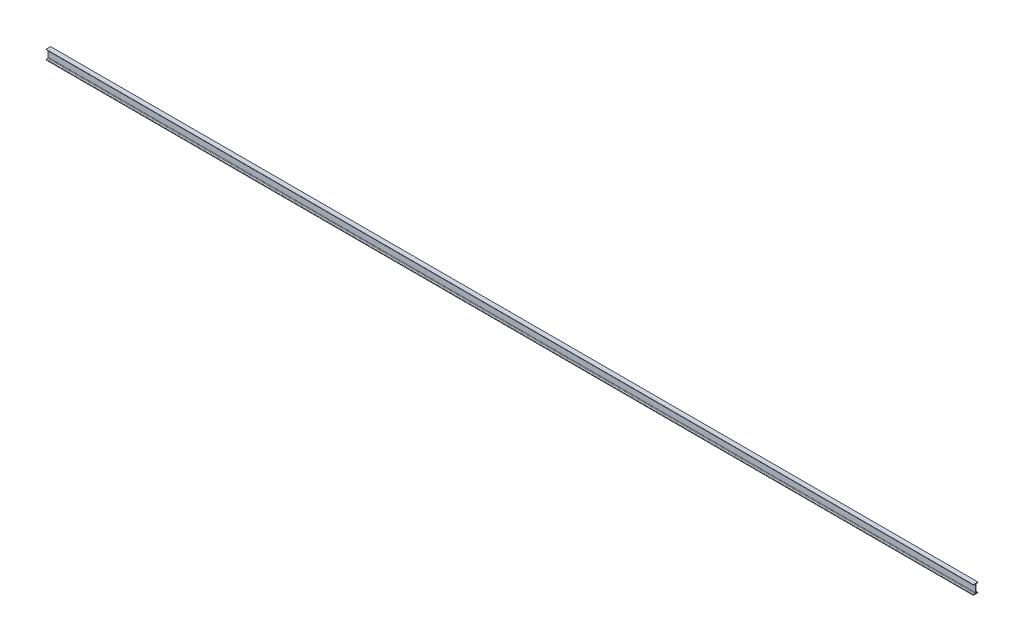
ISO-10303-21;
HEADER;
FILE_DESCRIPTION(('STEP AP214'),'2;1');
FILE_NAME('part.step','',(''),(''),'','','');
FILE_SCHEMA(('AUTOMOTIVE_DESIGN { 1 0 10303 214 1 1 1 1 }'));
ENDSEC;
DATA;
#1=APPLICATION_CONTEXT('core data for automotive mechanical design processes');
#2=APPLICATION_PROTOCOL_DEFINITION('international standard','automotive_design',2000,#1);
#3=PRODUCT_CONTEXT('',#1,'mechanical');
#4=PRODUCT('Part','Part','',(#3));
#5=PRODUCT_RELATED_PRODUCT_CATEGORY('part','',(#4));
#6=PRODUCT_DEFINITION_FORMATION('','',#4);
#7=PRODUCT_DEFINITION_CONTEXT('part definition',#1,'design');
#8=PRODUCT_DEFINITION('design','',#6,#7);
#9=PRODUCT_DEFINITION_SHAPE('','',#8);
#10=(LENGTH_UNIT() NAMED_UNIT(*) SI_UNIT(.MILLI.,.METRE.));
#11=(NAMED_UNIT(*) PLANE_ANGLE_UNIT() SI_UNIT($,.RADIAN.));
#12=(NAMED_UNIT(*) SI_UNIT($,.STERADIAN.) SOLID_ANGLE_UNIT());
#13=UNCERTAINTY_MEASURE_WITH_UNIT(LENGTH_MEASURE(1.E-05),#10,'distance_accuracy_value','');
#14=(GEOMETRIC_REPRESENTATION_CONTEXT(3) GLOBAL_UNCERTAINTY_ASSIGNED_CONTEXT((#13)) GLOBAL_UNIT_ASSIGNED_CONTEXT((#10,
#11,#12)) REPRESENTATION_CONTEXT('',''));
#15=CARTESIAN_POINT('',(0.,0.,0.));
#16=DIRECTION('',(0.,0.,1.));
#17=DIRECTION('',(1.,0.,0.));
#18=AXIS2_PLACEMENT_3D('',#15,#16,#17);
#19=CARTESIAN_POINT('',(12000.,59.9999999999996,30.0000000000007));
#20=DIRECTION('',(0.,-1.,0.));
#21=DIRECTION('',(0.,0.,-1.));
#22=AXIS2_PLACEMENT_3D('',#19,#20,#21);
#23=PLANE('',#22);
#24=DIRECTION('',(0.,0.,1.));
#25=VECTOR('',#24,1.);
#26=CARTESIAN_POINT('',(0.,59.9999999999996,30.0000000000007));
#27=LINE('',#26,#25);
#28=CARTESIAN_POINT('',(0.,60.0000000000002,-29.9999999999994));
#29=VERTEX_POINT('',#28);
#30=CARTESIAN_POINT('',(0.,59.9999999999996,30.0000000000007));
#31=VERTEX_POINT('',#30);
#32=EDGE_CURVE('E271',#29,#31,#27,.T.);
#33=ORIENTED_EDGE('',*,*,#32,.T.);
#34=DIRECTION('',(-1.,0.,0.));
#35=VECTOR('',#34,1.);
#36=CARTESIAN_POINT('',(12000.,59.9999999999996,30.0000000000007));
#37=LINE('',#36,#35);
#38=CARTESIAN_POINT('',(12000.,59.9999999999996,30.0000000000007));
#39=VERTEX_POINT('',#38);
#40=EDGE_CURVE('E13',#39,#31,#37,.T.);
#41=ORIENTED_EDGE('',*,*,#40,.F.);
#42=DIRECTION('',(0.,0.,1.));
#43=VECTOR('',#42,1.);
#44=CARTESIAN_POINT('',(12000.,59.9999999999996,30.0000000000007));
#45=LINE('',#44,#43);
#46=CARTESIAN_POINT('',(12000.,60.0000000000002,-29.9999999999994));
#47=VERTEX_POINT('',#46);
#48=EDGE_CURVE('E309',#47,#39,#45,.T.);
#49=ORIENTED_EDGE('',*,*,#48,.F.);
#50=DIRECTION('',(-1.,0.,0.));
#51=VECTOR('',#50,1.);
#52=CARTESIAN_POINT('',(12000.,60.0000000000002,-29.9999999999994));
#53=LINE('',#52,#51);
#54=EDGE_CURVE('E267',#47,#29,#53,.T.);
#55=ORIENTED_EDGE('',*,*,#54,.T.);
#56=EDGE_LOOP('',(#33,#41,#49,#55));
#57=FACE_BOUND('',#56,.T.);
#58=ADVANCED_FACE('F103',(#57),#23,.F.);
#59=CARTESIAN_POINT('',(12000.,58.080070834673,30.0000000000007));
#60=DIRECTION('',(0.,0.,-1.));
#61=DIRECTION('',(0.,1.,0.));
#62=AXIS2_PLACEMENT_3D('',#59,#60,#61);
#63=PLANE('',#62);
#64=DIRECTION('',(0.,-1.,0.));
#65=VECTOR('',#64,1.);
#66=CARTESIAN_POINT('',(0.,58.080070834673,30.0000000000007));
#67=LINE('',#66,#65);
#68=CARTESIAN_POINT('',(0.,58.080070834673,30.0000000000007));
#69=VERTEX_POINT('',#68);
#70=EDGE_CURVE('E274',#31,#69,#67,.T.);
#71=ORIENTED_EDGE('',*,*,#70,.T.);
#72=DIRECTION('',(-1.,0.,0.));
#73=VECTOR('',#72,1.);
#74=CARTESIAN_POINT('',(12000.,58.080070834673,30.0000000000007));
#75=LINE('',#74,#73);
#76=CARTESIAN_POINT('',(12000.,58.080070834673,30.0000000000007));
#77=VERTEX_POINT('',#76);
#78=EDGE_CURVE('E111',#77,#69,#75,.T.);
#79=ORIENTED_EDGE('',*,*,#78,.F.);
#80=DIRECTION('',(0.,-1.,0.));
#81=VECTOR('',#80,1.);
#82=CARTESIAN_POINT('',(12000.,58.080070834673,30.0000000000007));
#83=LINE('',#82,#81);
#84=EDGE_CURVE('E198',#39,#77,#83,.T.);
#85=ORIENTED_EDGE('',*,*,#84,.F.);
#86=ORIENTED_EDGE('',*,*,#40,.T.);
#87=EDGE_LOOP('',(#71,#79,#85,#86));
#88=FACE_BOUND('',#87,.T.);
#89=ADVANCED_FACE('F427',(#88),#63,.F.);
#90=CARTESIAN_POINT('',(12000.,58.0800708346731,26.0000000000007));
#91=DIRECTION('',(-1.,0.,0.));
#92=DIRECTION('',(0.,0.,1.));
#93=AXIS2_PLACEMENT_3D('',#90,#91,#92);
#94=CYLINDRICAL_SURFACE('',#93,3.99999999999999);
#95=CARTESIAN_POINT('',(0.,58.0800708346731,26.0000000000007));
#96=DIRECTION('',(1.,0.,0.));
#97=DIRECTION('',(0.,0.,-1.));
#98=AXIS2_PLACEMENT_3D('',#95,#96,#97);
#99=CIRCLE('',#98,3.99999999999999);
#100=CARTESIAN_POINT('',(0.,54.1345029187844,26.6576426241591));
#101=VERTEX_POINT('',#100);
#102=EDGE_CURVE('E276',#69,#101,#99,.T.);
#103=ORIENTED_EDGE('',*,*,#102,.T.);
#104=DIRECTION('',(-1.,0.,0.));
#105=VECTOR('',#104,1.);
#106=CARTESIAN_POINT('',(12000.,54.1345029187844,26.6576426241591));
#107=LINE('',#106,#105);
#108=CARTESIAN_POINT('',(12000.,54.1345029187844,26.6576426241591));
#109=VERTEX_POINT('',#108);
#110=EDGE_CURVE('E352',#109,#101,#107,.T.);
#111=ORIENTED_EDGE('',*,*,#110,.F.);
#112=CARTESIAN_POINT('',(12000.,58.0800708346731,26.0000000000007));
#113=DIRECTION('',(1.,0.,0.));
#114=DIRECTION('',(0.,0.,-1.));
#115=AXIS2_PLACEMENT_3D('',#112,#113,#114);
#116=CIRCLE('',#115,3.99999999999999);
#117=EDGE_CURVE('E360',#77,#109,#116,.T.);
#118=ORIENTED_EDGE('',*,*,#117,.F.);
#119=ORIENTED_EDGE('',*,*,#78,.T.);
#120=EDGE_LOOP('',(#103,#111,#118,#119));
#121=FACE_BOUND('',#120,.T.);
#122=ADVANCED_FACE('F358',(#121),#94,.T.);
#123=CARTESIAN_POINT('',(12000.,51.2221358317774,9.18471475168372));
#124=DIRECTION('',(0.,0.986391978972167,-0.1644106560396));
#125=DIRECTION('',(0.,0.1644106560396,0.986391978972167));
#126=AXIS2_PLACEMENT_3D('',#123,#124,#125);
#127=PLANE('',#126);
#128=DIRECTION('',(0.,-0.1644106560396,-0.986391978972167));
#129=VECTOR('',#128,1.);
#130=CARTESIAN_POINT('',(0.,51.2221358317774,9.18471475168372));
#131=LINE('',#130,#129);
#132=CARTESIAN_POINT('',(0.,51.2221358317774,9.18471475168372));
#133=VERTEX_POINT('',#132);
#134=EDGE_CURVE('E278',#101,#133,#131,.T.);
#135=ORIENTED_EDGE('',*,*,#134,.T.);
#136=DIRECTION('',(-1.,0.,0.));
#137=VECTOR('',#136,1.);
#138=CARTESIAN_POINT('',(12000.,51.2221358317774,9.18471475168372));
#139=LINE('',#138,#137);
#140=CARTESIAN_POINT('',(12000.,51.2221358317774,9.18471475168372));
#141=VERTEX_POINT('',#140);
#142=EDGE_CURVE('E349',#141,#133,#139,.T.);
#143=ORIENTED_EDGE('',*,*,#142,.F.);
#144=DIRECTION('',(0.,-0.1644106560396,-0.986391978972167));
#145=VECTOR('',#144,1.);
#146=CARTESIAN_POINT('',(12000.,51.2221358317774,9.18471475168372));
#147=LINE('',#146,#145);
#148=EDGE_CURVE('E378',#109,#141,#147,.T.);
#149=ORIENTED_EDGE('',*,*,#148,.F.);
#150=ORIENTED_EDGE('',*,*,#110,.T.);
#151=EDGE_LOOP('',(#135,#143,#149,#150));
#152=FACE_BOUND('',#151,.T.);
#153=ADVANCED_FACE('F369',(#152),#127,.F.);
#154=CARTESIAN_POINT('',(12000.,43.331,10.5000000000005));
#155=DIRECTION('',(-1.,0.,0.));
#156=DIRECTION('',(0.,0.,1.));
#157=AXIS2_PLACEMENT_3D('',#154,#155,#156);
#158=CYLINDRICAL_SURFACE('',#157,8.00000000000004);
#159=CARTESIAN_POINT('',(0.,43.331,10.5000000000005));
#160=DIRECTION('',(-1.,0.,0.));
#161=DIRECTION('',(0.,0.,-1.));
#162=AXIS2_PLACEMENT_3D('',#159,#160,#161);
#163=CIRCLE('',#162,8.00000000000004);
#164=CARTESIAN_POINT('',(0.,43.3310000000001,2.50000000000044));
#165=VERTEX_POINT('',#164);
#166=EDGE_CURVE('E280',#133,#165,#163,.T.);
#167=ORIENTED_EDGE('',*,*,#166,.T.);
#168=DIRECTION('',(-1.,0.,0.));
#169=VECTOR('',#168,1.);
#170=CARTESIAN_POINT('',(12000.,43.3310000000001,2.50000000000044));
#171=LINE('',#170,#169);
#172=CARTESIAN_POINT('',(12000.,43.3310000000001,2.50000000000044));
#173=VERTEX_POINT('',#172);
#174=EDGE_CURVE('E346',#173,#165,#171,.T.);
#175=ORIENTED_EDGE('',*,*,#174,.F.);
#176=CARTESIAN_POINT('',(12000.,43.331,10.5000000000005));
#177=DIRECTION('',(-1.,0.,0.));
#178=DIRECTION('',(0.,0.,-1.));
#179=AXIS2_PLACEMENT_3D('',#176,#177,#178);
#180=CIRCLE('',#179,8.00000000000004);
#181=EDGE_CURVE('E375',#141,#173,#180,.T.);
#182=ORIENTED_EDGE('',*,*,#181,.F.);
#183=ORIENTED_EDGE('',*,*,#142,.T.);
#184=EDGE_LOOP('',(#167,#175,#182,#183));
#185=FACE_BOUND('',#184,.T.);
#186=ADVANCED_FACE('F373',(#185),#158,.F.);
#187=CARTESIAN_POINT('',(12000.,-43.3309999999999,2.49999999999947));
#188=DIRECTION('',(0.,0.,-1.));
#189=DIRECTION('',(0.,1.,0.));
#190=AXIS2_PLACEMENT_3D('',#187,#188,#189);
#191=PLANE('',#190);
#192=DIRECTION('',(0.,-1.,0.));
#193=VECTOR('',#192,1.);
#194=CARTESIAN_POINT('',(0.,-43.3309999999999,2.49999999999947));
#195=LINE('',#194,#193);
#196=CARTESIAN_POINT('',(0.,-43.331,2.49999999999948));
#197=VERTEX_POINT('',#196);
#198=EDGE_CURVE('E282',#165,#197,#195,.T.);
#199=ORIENTED_EDGE('',*,*,#198,.T.);
#200=DIRECTION('',(-1.,0.,0.));
#201=VECTOR('',#200,1.);
#202=CARTESIAN_POINT('',(12000.,-43.331,2.49999999999948));
#203=LINE('',#202,#201);
#204=CARTESIAN_POINT('',(12000.,-43.331,2.49999999999948));
#205=VERTEX_POINT('',#204);
#206=EDGE_CURVE('E343',#205,#197,#203,.T.);
#207=ORIENTED_EDGE('',*,*,#206,.F.);
#208=DIRECTION('',(0.,-1.,0.));
#209=VECTOR('',#208,1.);
#210=CARTESIAN_POINT('',(12000.,-43.3309999999999,2.49999999999947));
#211=LINE('',#210,#209);
#212=EDGE_CURVE('E377',#173,#205,#211,.T.);
#213=ORIENTED_EDGE('',*,*,#212,.F.);
#214=ORIENTED_EDGE('',*,*,#174,.T.);
#215=EDGE_LOOP('',(#199,#207,#213,#214));
#216=FACE_BOUND('',#215,.T.);
#217=ADVANCED_FACE('F440',(#216),#191,.F.);
#218=CARTESIAN_POINT('',(12000.,-43.331,10.4999999999995));
#219=DIRECTION('',(-1.,0.,0.));
#220=DIRECTION('',(0.,0.,1.));
#221=AXIS2_PLACEMENT_3D('',#218,#219,#220);
#222=CYLINDRICAL_SURFACE('',#221,8.00000000000003);
#223=CARTESIAN_POINT('',(0.,-43.331,10.4999999999995));
#224=DIRECTION('',(-1.,0.,0.));
#225=DIRECTION('',(0.,0.,-1.));
#226=AXIS2_PLACEMENT_3D('',#223,#224,#225);
#227=CIRCLE('',#226,8.00000000000003);
#228=CARTESIAN_POINT('',(0.,-51.2221358317773,9.18471475168231));
#229=VERTEX_POINT('',#228);
#230=EDGE_CURVE('E284',#197,#229,#227,.T.);
#231=ORIENTED_EDGE('',*,*,#230,.T.);
#232=DIRECTION('',(-1.,0.,0.));
#233=VECTOR('',#232,1.);
#234=CARTESIAN_POINT('',(12000.,-51.2221358317773,9.18471475168231));
#235=LINE('',#234,#233);
#236=CARTESIAN_POINT('',(12000.,-51.2221358317773,9.18471475168231));
#237=VERTEX_POINT('',#236);
#238=EDGE_CURVE('E340',#237,#229,#235,.T.);
#239=ORIENTED_EDGE('',*,*,#238,.F.);
#240=CARTESIAN_POINT('',(12000.,-43.331,10.4999999999995));
#241=DIRECTION('',(-1.,0.,0.));
#242=DIRECTION('',(0.,0.,-1.));
#243=AXIS2_PLACEMENT_3D('',#240,#241,#242);
#244=CIRCLE('',#243,8.00000000000003);
#245=EDGE_CURVE('E380',#205,#237,#244,.T.);
#246=ORIENTED_EDGE('',*,*,#245,.F.);
#247=ORIENTED_EDGE('',*,*,#206,.T.);
#248=EDGE_LOOP('',(#231,#239,#246,#247));
#249=FACE_BOUND('',#248,.T.);
#250=ADVANCED_FACE('F443',(#249),#222,.F.);
#251=CARTESIAN_POINT('',(12000.,-54.1345029187853,26.6576426241579));
#252=DIRECTION('',(0.,-0.986391978972159,-0.164410656039648));
#253=DIRECTION('',(0.,0.164410656039648,-0.986391978972159));
#254=AXIS2_PLACEMENT_3D('',#251,#252,#253);
#255=PLANE('',#254);
#256=DIRECTION('',(0.,-0.164410656039648,0.986391978972159));
#257=VECTOR('',#256,1.);
#258=CARTESIAN_POINT('',(0.,-54.1345029187853,26.6576426241579));
#259=LINE('',#258,#257);
#260=CARTESIAN_POINT('',(0.,-54.1345029187853,26.6576426241579));
#261=VERTEX_POINT('',#260);
#262=EDGE_CURVE('E286',#229,#261,#259,.T.);
#263=ORIENTED_EDGE('',*,*,#262,.T.);
#264=DIRECTION('',(-1.,0.,0.));
#265=VECTOR('',#264,1.);
#266=CARTESIAN_POINT('',(12000.,-54.1345029187853,26.6576426241579));
#267=LINE('',#266,#265);
#268=CARTESIAN_POINT('',(12000.,-54.1345029187853,26.6576426241579));
#269=VERTEX_POINT('',#268);
#270=EDGE_CURVE('E337',#269,#261,#267,.T.);
#271=ORIENTED_EDGE('',*,*,#270,.F.);
#272=DIRECTION('',(0.,-0.164410656039648,0.986391978972159));
#273=VECTOR('',#272,1.);
#274=CARTESIAN_POINT('',(12000.,-54.1345029187853,26.6576426241579));
#275=LINE('',#274,#273);
#276=EDGE_CURVE('E386',#237,#269,#275,.T.);
#277=ORIENTED_EDGE('',*,*,#276,.F.);
#278=ORIENTED_EDGE('',*,*,#238,.T.);
#279=EDGE_LOOP('',(#263,#271,#277,#278));
#280=FACE_BOUND('',#279,.T.);
#281=ADVANCED_FACE('F447',(#280),#255,.F.);
#282=CARTESIAN_POINT('',(12000.,-58.0800708346739,25.9999999999993));
#283=DIRECTION('',(-1.,0.,0.));
#284=DIRECTION('',(0.,0.,1.));
#285=AXIS2_PLACEMENT_3D('',#282,#283,#284);
#286=CYLINDRICAL_SURFACE('',#285,3.99999999999999);
#287=CARTESIAN_POINT('',(0.,-58.0800708346739,25.9999999999993));
#288=DIRECTION('',(1.,0.,0.));
#289=DIRECTION('',(0.,0.,-1.));
#290=AXIS2_PLACEMENT_3D('',#287,#288,#289);
#291=CIRCLE('',#290,3.99999999999999);
#292=CARTESIAN_POINT('',(0.,-58.0800708346739,29.9999999999993));
#293=VERTEX_POINT('',#292);
#294=EDGE_CURVE('E288',#261,#293,#291,.T.);
#295=ORIENTED_EDGE('',*,*,#294,.T.);
#296=DIRECTION('',(-1.,0.,0.));
#297=VECTOR('',#296,1.);
#298=CARTESIAN_POINT('',(12000.,-58.0800708346739,29.9999999999993));
#299=LINE('',#298,#297);
#300=CARTESIAN_POINT('',(12000.,-58.0800708346739,29.9999999999993));
#301=VERTEX_POINT('',#300);
#302=EDGE_CURVE('E334',#301,#293,#299,.T.);
#303=ORIENTED_EDGE('',*,*,#302,.F.);
#304=CARTESIAN_POINT('',(12000.,-58.0800708346739,25.9999999999993));
#305=DIRECTION('',(1.,0.,0.));
#306=DIRECTION('',(0.,0.,-1.));
#307=AXIS2_PLACEMENT_3D('',#304,#305,#306);
#308=CIRCLE('',#307,3.99999999999999);
#309=EDGE_CURVE('E388',#269,#301,#308,.T.);
#310=ORIENTED_EDGE('',*,*,#309,.F.);
#311=ORIENTED_EDGE('',*,*,#270,.T.);
#312=EDGE_LOOP('',(#295,#303,#310,#311));
#313=FACE_BOUND('',#312,.T.);
#314=ADVANCED_FACE('F451',(#313),#286,.T.);
#315=CARTESIAN_POINT('',(12000.,-60.0000000000005,29.9999999999994));
#316=DIRECTION('',(0.,0.,-1.));
#317=DIRECTION('',(0.,1.,0.));
#318=AXIS2_PLACEMENT_3D('',#315,#316,#317);
#319=PLANE('',#318);
#320=DIRECTION('',(0.,-1.,0.));
#321=VECTOR('',#320,1.);
#322=CARTESIAN_POINT('',(0.,-60.0000000000005,29.9999999999994));
#323=LINE('',#322,#321);
#324=CARTESIAN_POINT('',(0.,-60.0000000000005,29.9999999999994));
#325=VERTEX_POINT('',#324);
#326=EDGE_CURVE('E290',#293,#325,#323,.T.);
#327=ORIENTED_EDGE('',*,*,#326,.T.);
#328=DIRECTION('',(-1.,0.,0.));
#329=VECTOR('',#328,1.);
#330=CARTESIAN_POINT('',(12000.,-60.0000000000005,29.9999999999994));
#331=LINE('',#330,#329);
#332=CARTESIAN_POINT('',(12000.,-60.0000000000005,29.9999999999994));
#333=VERTEX_POINT('',#332);
#334=EDGE_CURVE('E331',#333,#325,#331,.T.);
#335=ORIENTED_EDGE('',*,*,#334,.F.);
#336=DIRECTION('',(0.,-1.,0.));
#337=VECTOR('',#336,1.);
#338=CARTESIAN_POINT('',(12000.,-60.0000000000005,29.9999999999994));
#339=LINE('',#338,#337);
#340=EDGE_CURVE('E390',#301,#333,#339,.T.);
#341=ORIENTED_EDGE('',*,*,#340,.F.);
#342=ORIENTED_EDGE('',*,*,#302,.T.);
#343=EDGE_LOOP('',(#327,#335,#341,#342));
#344=FACE_BOUND('',#343,.T.);
#345=ADVANCED_FACE('F455',(#344),#319,.F.);
#346=CARTESIAN_POINT('',(12000.,-59.9999999999998,-30.0000000000006));
#347=DIRECTION('',(0.,1.,0.));
#348=DIRECTION('',(0.,0.,1.));
#349=AXIS2_PLACEMENT_3D('',#346,#347,#348);
#350=PLANE('',#349);
#351=DIRECTION('',(0.,0.,-1.));
#352=VECTOR('',#351,1.);
#353=CARTESIAN_POINT('',(0.,-59.9999999999998,-30.0000000000006));
#354=LINE('',#353,#352);
#355=CARTESIAN_POINT('',(0.,-59.9999999999998,-30.0000000000006));
#356=VERTEX_POINT('',#355);
#357=EDGE_CURVE('E292',#325,#356,#354,.T.);
#358=ORIENTED_EDGE('',*,*,#357,.T.);
#359=DIRECTION('',(-1.,0.,0.));
#360=VECTOR('',#359,1.);
#361=CARTESIAN_POINT('',(12000.,-59.9999999999998,-30.0000000000006));
#362=LINE('',#361,#360);
#363=CARTESIAN_POINT('',(12000.,-59.9999999999998,-30.0000000000006));
#364=VERTEX_POINT('',#363);
#365=EDGE_CURVE('E328',#364,#356,#362,.T.);
#366=ORIENTED_EDGE('',*,*,#365,.F.);
#367=DIRECTION('',(0.,0.,-1.));
#368=VECTOR('',#367,1.);
#369=CARTESIAN_POINT('',(12000.,-59.9999999999998,-30.0000000000006));
#370=LINE('',#369,#368);
#371=EDGE_CURVE('E392',#333,#364,#370,.T.);
#372=ORIENTED_EDGE('',*,*,#371,.F.);
#373=ORIENTED_EDGE('',*,*,#334,.T.);
#374=EDGE_LOOP('',(#358,#366,#372,#373));
#375=FACE_BOUND('',#374,.T.);
#376=ADVANCED_FACE('F459',(#375),#350,.F.);
#377=CARTESIAN_POINT('',(12000.,-58.0800708346733,-30.0000000000006));
#378=DIRECTION('',(0.,0.,1.));
#379=DIRECTION('',(0.,-1.,0.));
#380=AXIS2_PLACEMENT_3D('',#377,#378,#379);
#381=PLANE('',#380);
#382=DIRECTION('',(0.,1.,0.));
#383=VECTOR('',#382,1.);
#384=CARTESIAN_POINT('',(0.,-58.0800708346733,-30.0000000000006));
#385=LINE('',#384,#383);
#386=CARTESIAN_POINT('',(0.,-58.0800708346733,-30.0000000000006));
#387=VERTEX_POINT('',#386);
#388=EDGE_CURVE('E294',#356,#387,#385,.T.);
#389=ORIENTED_EDGE('',*,*,#388,.T.);
#390=DIRECTION('',(-1.,0.,0.));
#391=VECTOR('',#390,1.);
#392=CARTESIAN_POINT('',(12000.,-58.0800708346733,-30.0000000000006));
#393=LINE('',#392,#391);
#394=CARTESIAN_POINT('',(12000.,-58.0800708346733,-30.0000000000006));
#395=VERTEX_POINT('',#394);
#396=EDGE_CURVE('E325',#395,#387,#393,.T.);
#397=ORIENTED_EDGE('',*,*,#396,.F.);
#398=DIRECTION('',(0.,1.,0.));
#399=VECTOR('',#398,1.);
#400=CARTESIAN_POINT('',(12000.,-58.0800708346733,-30.0000000000006));
#401=LINE('',#400,#399);
#402=EDGE_CURVE('E394',#364,#395,#401,.T.);
#403=ORIENTED_EDGE('',*,*,#402,.F.);
#404=ORIENTED_EDGE('',*,*,#365,.T.);
#405=EDGE_LOOP('',(#389,#397,#403,#404));
#406=FACE_BOUND('',#405,.T.);
#407=ADVANCED_FACE('F463',(#406),#381,.F.);
#408=CARTESIAN_POINT('',(12000.,-58.0800708346734,-26.0000000000007));
#409=DIRECTION('',(-1.,0.,0.));
#410=DIRECTION('',(0.,0.,1.));
#411=AXIS2_PLACEMENT_3D('',#408,#409,#410);
#412=CYLINDRICAL_SURFACE('',#411,3.99999999999998);
#413=CARTESIAN_POINT('',(0.,-58.0800708346734,-26.0000000000007));
#414=DIRECTION('',(1.,0.,0.));
#415=DIRECTION('',(0.,0.,1.));
#416=AXIS2_PLACEMENT_3D('',#413,#414,#415);
#417=CIRCLE('',#416,3.99999999999998);
#418=CARTESIAN_POINT('',(0.,-54.1345029187847,-26.6576426241592));
#419=VERTEX_POINT('',#418);
#420=EDGE_CURVE('E296',#387,#419,#417,.T.);
#421=ORIENTED_EDGE('',*,*,#420,.T.);
#422=DIRECTION('',(-1.,0.,0.));
#423=VECTOR('',#422,1.);
#424=CARTESIAN_POINT('',(12000.,-54.1345029187847,-26.6576426241592));
#425=LINE('',#424,#423);
#426=CARTESIAN_POINT('',(12000.,-54.1345029187847,-26.6576426241592));
#427=VERTEX_POINT('',#426);
#428=EDGE_CURVE('E322',#427,#419,#425,.T.);
#429=ORIENTED_EDGE('',*,*,#428,.F.);
#430=CARTESIAN_POINT('',(12000.,-58.0800708346734,-26.0000000000007));
#431=DIRECTION('',(1.,0.,0.));
#432=DIRECTION('',(0.,0.,1.));
#433=AXIS2_PLACEMENT_3D('',#430,#431,#432);
#434=CIRCLE('',#433,3.99999999999998);
#435=EDGE_CURVE('E396',#395,#427,#434,.T.);
#436=ORIENTED_EDGE('',*,*,#435,.F.);
#437=ORIENTED_EDGE('',*,*,#396,.T.);
#438=EDGE_LOOP('',(#421,#429,#436,#437));
#439=FACE_BOUND('',#438,.T.);
#440=ADVANCED_FACE('F467',(#439),#412,.T.);
#441=CARTESIAN_POINT('',(12000.,-51.2221358317772,-9.1847147516835));
#442=DIRECTION('',(0.,-0.986391978972163,0.164410656039625));
#443=DIRECTION('',(0.,-0.164410656039625,-0.986391978972163));
#444=AXIS2_PLACEMENT_3D('',#441,#442,#443);
#445=PLANE('',#444);
#446=DIRECTION('',(0.,0.164410656039625,0.986391978972163));
#447=VECTOR('',#446,1.);
#448=CARTESIAN_POINT('',(0.,-51.2221358317772,-9.1847147516835));
#449=LINE('',#448,#447);
#450=CARTESIAN_POINT('',(0.,-51.2221358317772,-9.1847147516835));
#451=VERTEX_POINT('',#450);
#452=EDGE_CURVE('E298',#419,#451,#449,.T.);
#453=ORIENTED_EDGE('',*,*,#452,.T.);
#454=DIRECTION('',(-1.,0.,0.));
#455=VECTOR('',#454,1.);
#456=CARTESIAN_POINT('',(12000.,-51.2221358317772,-9.1847147516835));
#457=LINE('',#456,#455);
#458=CARTESIAN_POINT('',(12000.,-51.2221358317772,-9.1847147516835));
#459=VERTEX_POINT('',#458);
#460=EDGE_CURVE('E319',#459,#451,#457,.T.);
#461=ORIENTED_EDGE('',*,*,#460,.F.);
#462=DIRECTION('',(0.,0.164410656039625,0.986391978972163));
#463=VECTOR('',#462,1.);
#464=CARTESIAN_POINT('',(12000.,-51.2221358317772,-9.1847147516835));
#465=LINE('',#464,#463);
#466=EDGE_CURVE('E398',#427,#459,#465,.T.);
#467=ORIENTED_EDGE('',*,*,#466,.F.);
#468=ORIENTED_EDGE('',*,*,#428,.T.);
#469=EDGE_LOOP('',(#453,#461,#467,#468));
#470=FACE_BOUND('',#469,.T.);
#471=ADVANCED_FACE('F471',(#470),#445,.F.);
#472=CARTESIAN_POINT('',(12000.,-43.3309999999999,-10.5000000000005));
#473=DIRECTION('',(-1.,0.,0.));
#474=DIRECTION('',(0.,0.,1.));
#475=AXIS2_PLACEMENT_3D('',#472,#473,#474);
#476=CYLINDRICAL_SURFACE('',#475,8.);
#477=CARTESIAN_POINT('',(0.,-43.3309999999999,-10.5000000000005));
#478=DIRECTION('',(-1.,0.,0.));
#479=DIRECTION('',(0.,0.,-1.));
#480=AXIS2_PLACEMENT_3D('',#477,#478,#479);
#481=CIRCLE('',#480,8.);
#482=CARTESIAN_POINT('',(0.,-43.331,-2.50000000000053));
#483=VERTEX_POINT('',#482);
#484=EDGE_CURVE('E300',#451,#483,#481,.T.);
#485=ORIENTED_EDGE('',*,*,#484,.T.);
#486=DIRECTION('',(-1.,0.,0.));
#487=VECTOR('',#486,1.);
#488=CARTESIAN_POINT('',(12000.,-43.331,-2.50000000000053));
#489=LINE('',#488,#487);
#490=CARTESIAN_POINT('',(12000.,-43.331,-2.50000000000053));
#491=VERTEX_POINT('',#490);
#492=EDGE_CURVE('E316',#491,#483,#489,.T.);
#493=ORIENTED_EDGE('',*,*,#492,.F.);
#494=CARTESIAN_POINT('',(12000.,-43.3309999999999,-10.5000000000005));
#495=DIRECTION('',(-1.,0.,0.));
#496=DIRECTION('',(0.,0.,-1.));
#497=AXIS2_PLACEMENT_3D('',#494,#495,#496);
#498=CIRCLE('',#497,8.);
#499=EDGE_CURVE('E400',#459,#491,#498,.T.);
#500=ORIENTED_EDGE('',*,*,#499,.F.);
#501=ORIENTED_EDGE('',*,*,#460,.T.);
#502=EDGE_LOOP('',(#485,#493,#500,#501));
#503=FACE_BOUND('',#502,.T.);
#504=ADVANCED_FACE('F475',(#503),#476,.F.);
#505=CARTESIAN_POINT('',(12000.,43.3310000000001,-2.49999999999956));
#506=DIRECTION('',(0.,0.,1.));
#507=DIRECTION('',(0.,-1.,0.));
#508=AXIS2_PLACEMENT_3D('',#505,#506,#507);
#509=PLANE('',#508);
#510=DIRECTION('',(0.,1.,0.));
#511=VECTOR('',#510,1.);
#512=CARTESIAN_POINT('',(0.,43.3310000000001,-2.49999999999956));
#513=LINE('',#512,#511);
#514=CARTESIAN_POINT('',(0.,43.3310000000001,-2.49999999999958));
#515=VERTEX_POINT('',#514);
#516=EDGE_CURVE('E302',#483,#515,#513,.T.);
#517=ORIENTED_EDGE('',*,*,#516,.T.);
#518=DIRECTION('',(-1.,0.,0.));
#519=VECTOR('',#518,1.);
#520=CARTESIAN_POINT('',(12000.,43.3310000000001,-2.49999999999958));
#521=LINE('',#520,#519);
#522=CARTESIAN_POINT('',(12000.,43.3310000000001,-2.49999999999958));
#523=VERTEX_POINT('',#522);
#524=EDGE_CURVE('E313',#523,#515,#521,.T.);
#525=ORIENTED_EDGE('',*,*,#524,.F.);
#526=DIRECTION('',(0.,1.,0.));
#527=VECTOR('',#526,1.);
#528=CARTESIAN_POINT('',(12000.,43.3310000000001,-2.49999999999956));
#529=LINE('',#528,#527);
#530=EDGE_CURVE('E402',#491,#523,#529,.T.);
#531=ORIENTED_EDGE('',*,*,#530,.F.);
#532=ORIENTED_EDGE('',*,*,#492,.T.);
#533=EDGE_LOOP('',(#517,#525,#531,#532));
#534=FACE_BOUND('',#533,.T.);
#535=ADVANCED_FACE('F408',(#534),#509,.F.);
#536=CARTESIAN_POINT('',(12000.,43.3310000000001,-10.4999999999996));
#537=DIRECTION('',(-1.,0.,0.));
#538=DIRECTION('',(0.,0.,1.));
#539=AXIS2_PLACEMENT_3D('',#536,#537,#538);
#540=CYLINDRICAL_SURFACE('',#539,8.);
#541=CARTESIAN_POINT('',(0.,43.3310000000001,-10.4999999999996));
#542=DIRECTION('',(-1.,0.,0.));
#543=DIRECTION('',(0.,0.,-1.));
#544=AXIS2_PLACEMENT_3D('',#541,#542,#543);
#545=CIRCLE('',#544,8.);
#546=CARTESIAN_POINT('',(0.,51.2221358317774,-9.18471475168251));
#547=VERTEX_POINT('',#546);
#548=EDGE_CURVE('E304',#515,#547,#545,.T.);
#549=ORIENTED_EDGE('',*,*,#548,.T.);
#550=DIRECTION('',(-1.,0.,0.));
#551=VECTOR('',#550,1.);
#552=CARTESIAN_POINT('',(12000.,51.2221358317774,-9.18471475168251));
#553=LINE('',#552,#551);
#554=CARTESIAN_POINT('',(12000.,51.2221358317774,-9.18471475168251));
#555=VERTEX_POINT('',#554);
#556=EDGE_CURVE('E262',#555,#547,#553,.T.);
#557=ORIENTED_EDGE('',*,*,#556,.F.);
#558=CARTESIAN_POINT('',(12000.,43.3310000000001,-10.4999999999996));
#559=DIRECTION('',(-1.,0.,0.));
#560=DIRECTION('',(0.,0.,-1.));
#561=AXIS2_PLACEMENT_3D('',#558,#559,#560);
#562=CIRCLE('',#561,8.);
#563=EDGE_CURVE('E253',#523,#555,#562,.T.);
#564=ORIENTED_EDGE('',*,*,#563,.F.);
#565=ORIENTED_EDGE('',*,*,#524,.T.);
#566=EDGE_LOOP('',(#549,#557,#564,#565));
#567=FACE_BOUND('',#566,.T.);
#568=ADVANCED_FACE('F412',(#567),#540,.F.);
#569=CARTESIAN_POINT('',(12000.,54.134502918785,-26.6576426241578));
#570=DIRECTION('',(0.,0.986391978972162,0.164410656039632));
#571=DIRECTION('',(0.,-0.164410656039632,0.986391978972162));
#572=AXIS2_PLACEMENT_3D('',#569,#570,#571);
#573=PLANE('',#572);
#574=DIRECTION('',(0.,0.164410656039632,-0.986391978972162));
#575=VECTOR('',#574,1.);
#576=CARTESIAN_POINT('',(0.,54.134502918785,-26.6576426241578));
#577=LINE('',#576,#575);
#578=CARTESIAN_POINT('',(0.,54.134502918785,-26.6576426241578));
#579=VERTEX_POINT('',#578);
#580=EDGE_CURVE('E261',#547,#579,#577,.T.);
#581=ORIENTED_EDGE('',*,*,#580,.T.);
#582=DIRECTION('',(-1.,0.,0.));
#583=VECTOR('',#582,1.);
#584=CARTESIAN_POINT('',(12000.,54.134502918785,-26.6576426241578));
#585=LINE('',#584,#583);
#586=CARTESIAN_POINT('',(12000.,54.134502918785,-26.6576426241578));
#587=VERTEX_POINT('',#586);
#588=EDGE_CURVE('E258',#587,#579,#585,.T.);
#589=ORIENTED_EDGE('',*,*,#588,.F.);
#590=DIRECTION('',(0.,0.164410656039632,-0.986391978972162));
#591=VECTOR('',#590,1.);
#592=CARTESIAN_POINT('',(12000.,54.134502918785,-26.6576426241578));
#593=LINE('',#592,#591);
#594=EDGE_CURVE('E247',#555,#587,#593,.T.);
#595=ORIENTED_EDGE('',*,*,#594,.F.);
#596=ORIENTED_EDGE('',*,*,#556,.T.);
#597=EDGE_LOOP('',(#581,#589,#595,#596));
#598=FACE_BOUND('',#597,.T.);
#599=ADVANCED_FACE('F259',(#598),#573,.F.);
#600=CARTESIAN_POINT('',(12000.,58.0800708346737,-25.9999999999992));
#601=DIRECTION('',(-1.,0.,0.));
#602=DIRECTION('',(0.,0.,1.));
#603=AXIS2_PLACEMENT_3D('',#600,#601,#602);
#604=CYLINDRICAL_SURFACE('',#603,3.99999999999999);
#605=CARTESIAN_POINT('',(0.,58.0800708346737,-25.9999999999992));
#606=DIRECTION('',(1.,0.,0.));
#607=DIRECTION('',(0.,0.,1.));
#608=AXIS2_PLACEMENT_3D('',#605,#606,#607);
#609=CIRCLE('',#608,3.99999999999999);
#610=CARTESIAN_POINT('',(0.,58.0800708346737,-29.9999999999992));
#611=VERTEX_POINT('',#610);
#612=EDGE_CURVE('E184',#579,#611,#609,.T.);
#613=ORIENTED_EDGE('',*,*,#612,.T.);
#614=DIRECTION('',(-1.,0.,0.));
#615=VECTOR('',#614,1.);
#616=CARTESIAN_POINT('',(12000.,58.0800708346737,-29.9999999999992));
#617=LINE('',#616,#615);
#618=CARTESIAN_POINT('',(12000.,58.0800708346737,-29.9999999999992));
#619=VERTEX_POINT('',#618);
#620=EDGE_CURVE('E263',#619,#611,#617,.T.);
#621=ORIENTED_EDGE('',*,*,#620,.F.);
#622=CARTESIAN_POINT('',(12000.,58.0800708346737,-25.9999999999992));
#623=DIRECTION('',(1.,0.,0.));
#624=DIRECTION('',(0.,0.,1.));
#625=AXIS2_PLACEMENT_3D('',#622,#623,#624);
#626=CIRCLE('',#625,3.99999999999999);
#627=EDGE_CURVE('E251',#587,#619,#626,.T.);
#628=ORIENTED_EDGE('',*,*,#627,.F.);
#629=ORIENTED_EDGE('',*,*,#588,.T.);
#630=EDGE_LOOP('',(#613,#621,#628,#629));
#631=FACE_BOUND('',#630,.T.);
#632=ADVANCED_FACE('F265',(#631),#604,.T.);
#633=CARTESIAN_POINT('',(12000.,60.0000000000002,-29.9999999999994));
#634=DIRECTION('',(0.,0.,1.));
#635=DIRECTION('',(0.,-1.,0.));
#636=AXIS2_PLACEMENT_3D('',#633,#634,#635);
#637=PLANE('',#636);
#638=DIRECTION('',(0.,1.,0.));
#639=VECTOR('',#638,1.);
#640=CARTESIAN_POINT('',(0.,60.0000000000002,-29.9999999999994));
#641=LINE('',#640,#639);
#642=EDGE_CURVE('E190',#611,#29,#641,.T.);
#643=ORIENTED_EDGE('',*,*,#642,.T.);
#644=ORIENTED_EDGE('',*,*,#54,.F.);
#645=DIRECTION('',(0.,1.,0.));
#646=VECTOR('',#645,1.);
#647=CARTESIAN_POINT('',(12000.,60.0000000000002,-29.9999999999994));
#648=LINE('',#647,#646);
#649=EDGE_CURVE('E119',#619,#47,#648,.T.);
#650=ORIENTED_EDGE('',*,*,#649,.F.);
#651=ORIENTED_EDGE('',*,*,#620,.T.);
#652=EDGE_LOOP('',(#643,#644,#650,#651));
#653=FACE_BOUND('',#652,.T.);
#654=ADVANCED_FACE('F416',(#653),#637,.F.);
#655=CARTESIAN_POINT('',(12000.,58.0800708346737,-25.9999999999992));
#656=DIRECTION('',(-1.,0.,0.));
#657=DIRECTION('',(0.,0.,1.));
#658=AXIS2_PLACEMENT_3D('',#655,#656,#657);
#659=PLANE('',#658);
#660=ORIENTED_EDGE('',*,*,#48,.T.);
#661=ORIENTED_EDGE('',*,*,#84,.T.);
#662=ORIENTED_EDGE('',*,*,#117,.T.);
#663=ORIENTED_EDGE('',*,*,#148,.T.);
#664=ORIENTED_EDGE('',*,*,#181,.T.);
#665=ORIENTED_EDGE('',*,*,#212,.T.);
#666=ORIENTED_EDGE('',*,*,#245,.T.);
#667=ORIENTED_EDGE('',*,*,#276,.T.);
#668=ORIENTED_EDGE('',*,*,#309,.T.);
#669=ORIENTED_EDGE('',*,*,#340,.T.);
#670=ORIENTED_EDGE('',*,*,#371,.T.);
#671=ORIENTED_EDGE('',*,*,#402,.T.);
#672=ORIENTED_EDGE('',*,*,#435,.T.);
#673=ORIENTED_EDGE('',*,*,#466,.T.);
#674=ORIENTED_EDGE('',*,*,#499,.T.);
#675=ORIENTED_EDGE('',*,*,#530,.T.);
#676=ORIENTED_EDGE('',*,*,#563,.T.);
#677=ORIENTED_EDGE('',*,*,#594,.T.);
#678=ORIENTED_EDGE('',*,*,#627,.T.);
#679=ORIENTED_EDGE('',*,*,#649,.T.);
#680=EDGE_LOOP('',(#660,#661,#662,#663,#664,#665,#666,#667,#668,#669,#670,#671,#672,#673,#674,
#675,#676,#677,#678,#679));
#681=FACE_BOUND('',#680,.T.);
#682=ADVANCED_FACE('F249',(#681),#659,.F.);
#683=CARTESIAN_POINT('',(0.,58.0800708346737,-25.9999999999992));
#684=DIRECTION('',(-1.,0.,0.));
#685=DIRECTION('',(0.,0.,1.));
#686=AXIS2_PLACEMENT_3D('',#683,#684,#685);
#687=PLANE('',#686);
#688=ORIENTED_EDGE('',*,*,#32,.F.);
#689=ORIENTED_EDGE('',*,*,#642,.F.);
#690=ORIENTED_EDGE('',*,*,#612,.F.);
#691=ORIENTED_EDGE('',*,*,#580,.F.);
#692=ORIENTED_EDGE('',*,*,#548,.F.);
#693=ORIENTED_EDGE('',*,*,#516,.F.);
#694=ORIENTED_EDGE('',*,*,#484,.F.);
#695=ORIENTED_EDGE('',*,*,#452,.F.);
#696=ORIENTED_EDGE('',*,*,#420,.F.);
#697=ORIENTED_EDGE('',*,*,#388,.F.);
#698=ORIENTED_EDGE('',*,*,#357,.F.);
#699=ORIENTED_EDGE('',*,*,#326,.F.);
#700=ORIENTED_EDGE('',*,*,#294,.F.);
#701=ORIENTED_EDGE('',*,*,#262,.F.);
#702=ORIENTED_EDGE('',*,*,#230,.F.);
#703=ORIENTED_EDGE('',*,*,#198,.F.);
#704=ORIENTED_EDGE('',*,*,#166,.F.);
#705=ORIENTED_EDGE('',*,*,#134,.F.);
#706=ORIENTED_EDGE('',*,*,#102,.F.);
#707=ORIENTED_EDGE('',*,*,#70,.F.);
#708=EDGE_LOOP('',(#688,#689,#690,#691,#692,#693,#694,#695,#696,#697,#698,#699,#700,#701,#702,
#703,#704,#705,#706,#707));
#709=FACE_BOUND('',#708,.T.);
#710=ADVANCED_FACE('F364',(#709),#687,.T.);
#711=CLOSED_SHELL('',(#58,#89,#122,#153,#186,#217,#250,#281,#314,#345,#376,#407,#440,#471,#504,
#535,#568,#599,#632,#654,#682,#710));
#712=MANIFOLD_SOLID_BREP('B2',#711);
#713=ADVANCED_BREP_SHAPE_REPRESENTATION('',(#18,#712),#14);
#714=SHAPE_DEFINITION_REPRESENTATION(#9,#713);
ENDSEC;
END-ISO-10303-21;
